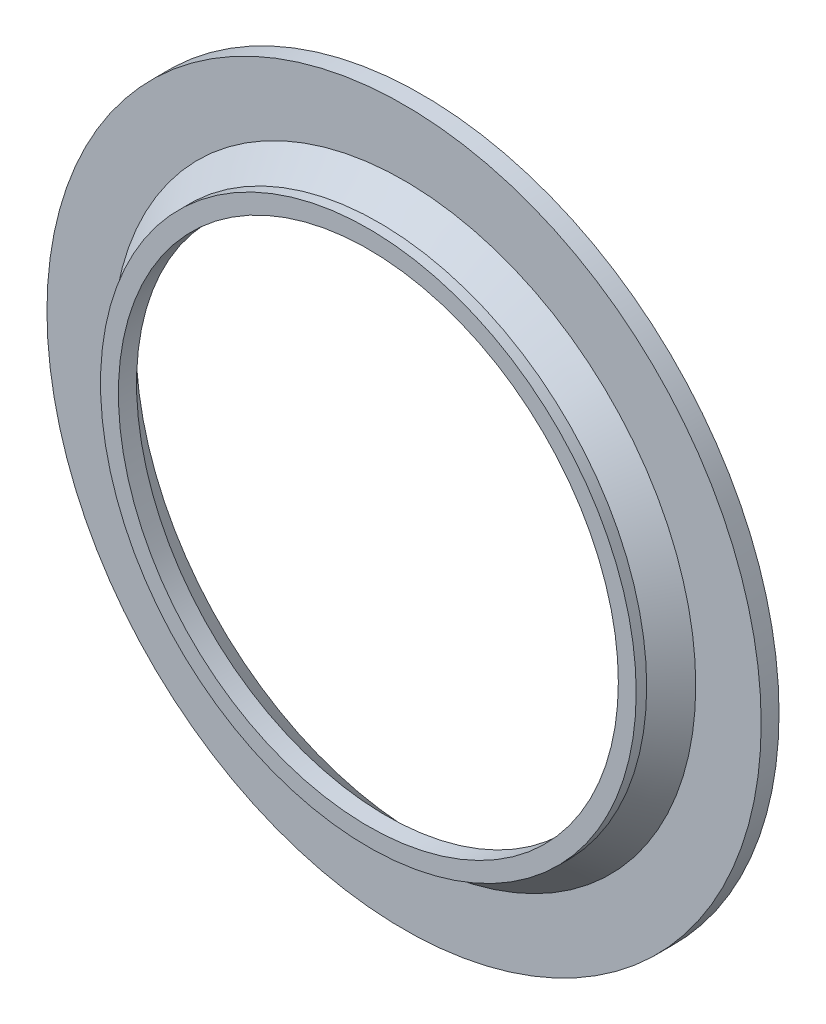
ISO-10303-21;
HEADER;
FILE_DESCRIPTION(('STEP AP214'),'2;1');
FILE_NAME('part.step','',(''),(''),'','','');
FILE_SCHEMA(('AUTOMOTIVE_DESIGN { 1 0 10303 214 1 1 1 1 }'));
ENDSEC;
DATA;
#1=APPLICATION_CONTEXT('core data for automotive mechanical design processes');
#2=APPLICATION_PROTOCOL_DEFINITION('international standard','automotive_design',2000,#1);
#3=PRODUCT_CONTEXT('',#1,'mechanical');
#4=PRODUCT('Part','Part','',(#3));
#5=PRODUCT_RELATED_PRODUCT_CATEGORY('part','',(#4));
#6=PRODUCT_DEFINITION_FORMATION('','',#4);
#7=PRODUCT_DEFINITION_CONTEXT('part definition',#1,'design');
#8=PRODUCT_DEFINITION('design','',#6,#7);
#9=PRODUCT_DEFINITION_SHAPE('','',#8);
#10=(LENGTH_UNIT() NAMED_UNIT(*) SI_UNIT(.MILLI.,.METRE.));
#11=(NAMED_UNIT(*) PLANE_ANGLE_UNIT() SI_UNIT($,.RADIAN.));
#12=(NAMED_UNIT(*) SI_UNIT($,.STERADIAN.) SOLID_ANGLE_UNIT());
#13=UNCERTAINTY_MEASURE_WITH_UNIT(LENGTH_MEASURE(1.E-05),#10,'distance_accuracy_value','');
#14=(GEOMETRIC_REPRESENTATION_CONTEXT(3) GLOBAL_UNCERTAINTY_ASSIGNED_CONTEXT((#13)) GLOBAL_UNIT_ASSIGNED_CONTEXT((#10,
#11,#12)) REPRESENTATION_CONTEXT('',''));
#15=CARTESIAN_POINT('',(0.,0.,0.));
#16=DIRECTION('',(0.,0.,1.));
#17=DIRECTION('',(1.,0.,0.));
#18=AXIS2_PLACEMENT_3D('',#15,#16,#17);
#19=CARTESIAN_POINT('',(1.5,0.,0.));
#20=DIRECTION('',(0.,0.,1.));
#21=DIRECTION('',(1.,0.,0.));
#22=AXIS2_PLACEMENT_3D('',#19,#20,#21);
#23=PLANE('',#22);
#24=CARTESIAN_POINT('',(0.,0.,0.));
#25=DIRECTION('',(0.,0.,1.));
#26=DIRECTION('',(1.,0.,0.));
#27=AXIS2_PLACEMENT_3D('',#24,#25,#26);
#28=CIRCLE('',#27,1.5);
#29=CARTESIAN_POINT('',(1.5,0.,0.));
#30=VERTEX_POINT('',#29);
#31=EDGE_CURVE('E72',#30,#30,#28,.T.);
#32=ORIENTED_EDGE('',*,*,#31,.T.);
#33=EDGE_LOOP('',(#32));
#34=FACE_BOUND('',#33,.T.);
#35=CARTESIAN_POINT('',(0.,0.,0.));
#36=DIRECTION('',(0.,0.,1.));
#37=DIRECTION('',(1.,0.,0.));
#38=AXIS2_PLACEMENT_3D('',#35,#36,#37);
#39=CIRCLE('',#38,1.4);
#40=CARTESIAN_POINT('',(1.4,0.,0.));
#41=VERTEX_POINT('',#40);
#42=EDGE_CURVE('E10',#41,#41,#39,.T.);
#43=ORIENTED_EDGE('',*,*,#42,.F.);
#44=EDGE_LOOP('',(#43));
#45=FACE_BOUND('',#44,.T.);
#46=ADVANCED_FACE('F37',(#34,#45),#23,.T.);
#47=CARTESIAN_POINT('',(0.,0.,0.));
#48=DIRECTION('',(0.,0.,1.));
#49=DIRECTION('',(1.,0.,0.));
#50=AXIS2_PLACEMENT_3D('',#47,#48,#49);
#51=CYLINDRICAL_SURFACE('',#50,1.4);
#52=ORIENTED_EDGE('',*,*,#42,.T.);
#53=EDGE_LOOP('',(#52));
#54=FACE_BOUND('',#53,.T.);
#55=CARTESIAN_POINT('',(0.,0.,-0.101718500595141));
#56=DIRECTION('',(0.,0.,1.));
#57=DIRECTION('',(1.,0.,0.));
#58=AXIS2_PLACEMENT_3D('',#55,#56,#57);
#59=CIRCLE('',#58,1.4);
#60=CARTESIAN_POINT('',(1.4,0.,-0.101718500595141));
#61=VERTEX_POINT('',#60);
#62=EDGE_CURVE('E44',#61,#61,#59,.T.);
#63=ORIENTED_EDGE('',*,*,#62,.F.);
#64=EDGE_LOOP('',(#63));
#65=FACE_BOUND('',#64,.T.);
#66=ADVANCED_FACE('F91',(#54,#65),#51,.F.);
#67=CARTESIAN_POINT('',(0.,0.,-0.3));
#68=DIRECTION('',(0.,0.,-1.));
#69=DIRECTION('',(-1.,0.,0.));
#70=AXIS2_PLACEMENT_3D('',#67,#68,#69);
#71=CONICAL_SURFACE('',#70,1.60199102798198,0.794665405411529);
#72=ORIENTED_EDGE('',*,*,#62,.T.);
#73=EDGE_LOOP('',(#72));
#74=FACE_BOUND('',#73,.T.);
#75=CARTESIAN_POINT('',(0.,0.,-0.3));
#76=DIRECTION('',(0.,0.,1.));
#77=DIRECTION('',(1.,0.,0.));
#78=AXIS2_PLACEMENT_3D('',#75,#76,#77);
#79=CIRCLE('',#78,1.60199102798198);
#80=CARTESIAN_POINT('',(1.60199102798198,0.,-0.3));
#81=VERTEX_POINT('',#80);
#82=EDGE_CURVE('E49',#81,#81,#79,.T.);
#83=ORIENTED_EDGE('',*,*,#82,.F.);
#84=EDGE_LOOP('',(#83));
#85=FACE_BOUND('',#84,.T.);
#86=ADVANCED_FACE('F95',(#74,#85),#71,.F.);
#87=CARTESIAN_POINT('',(1.60199102798198,0.,-0.3));
#88=DIRECTION('',(0.,0.,-1.));
#89=DIRECTION('',(-1.,0.,0.));
#90=AXIS2_PLACEMENT_3D('',#87,#88,#89);
#91=PLANE('',#90);
#92=ORIENTED_EDGE('',*,*,#82,.T.);
#93=EDGE_LOOP('',(#92));
#94=FACE_BOUND('',#93,.T.);
#95=CARTESIAN_POINT('',(0.,0.,-0.3));
#96=DIRECTION('',(0.,0.,1.));
#97=DIRECTION('',(1.,0.,0.));
#98=AXIS2_PLACEMENT_3D('',#95,#96,#97);
#99=CIRCLE('',#98,2.);
#100=CARTESIAN_POINT('',(2.,0.,-0.3));
#101=VERTEX_POINT('',#100);
#102=EDGE_CURVE('E54',#101,#101,#99,.T.);
#103=ORIENTED_EDGE('',*,*,#102,.F.);
#104=EDGE_LOOP('',(#103));
#105=FACE_BOUND('',#104,.T.);
#106=ADVANCED_FACE('F99',(#94,#105),#91,.T.);
#107=CARTESIAN_POINT('',(0.,0.,0.));
#108=DIRECTION('',(0.,0.,1.));
#109=DIRECTION('',(1.,0.,0.));
#110=AXIS2_PLACEMENT_3D('',#107,#108,#109);
#111=CYLINDRICAL_SURFACE('',#110,2.);
#112=ORIENTED_EDGE('',*,*,#102,.T.);
#113=EDGE_LOOP('',(#112));
#114=FACE_BOUND('',#113,.T.);
#115=CARTESIAN_POINT('',(0.,0.,-0.2));
#116=DIRECTION('',(0.,0.,1.));
#117=DIRECTION('',(1.,0.,0.));
#118=AXIS2_PLACEMENT_3D('',#115,#116,#117);
#119=CIRCLE('',#118,2.);
#120=CARTESIAN_POINT('',(2.,0.,-0.2));
#121=VERTEX_POINT('',#120);
#122=EDGE_CURVE('E60',#121,#121,#119,.T.);
#123=ORIENTED_EDGE('',*,*,#122,.F.);
#124=EDGE_LOOP('',(#123));
#125=FACE_BOUND('',#124,.T.);
#126=ADVANCED_FACE('F105',(#114,#125),#111,.T.);
#127=CARTESIAN_POINT('',(1.63350543350026,0.,-0.2));
#128=DIRECTION('',(0.,0.,1.));
#129=DIRECTION('',(1.,0.,0.));
#130=AXIS2_PLACEMENT_3D('',#127,#128,#129);
#131=PLANE('',#130);
#132=ORIENTED_EDGE('',*,*,#122,.T.);
#133=EDGE_LOOP('',(#132));
#134=FACE_BOUND('',#133,.T.);
#135=CARTESIAN_POINT('',(0.,0.,-0.2));
#136=DIRECTION('',(0.,0.,1.));
#137=DIRECTION('',(1.,0.,0.));
#138=AXIS2_PLACEMENT_3D('',#135,#136,#137);
#139=CIRCLE('',#138,1.63350543350026);
#140=CARTESIAN_POINT('',(1.63350543350026,0.,-0.2));
#141=VERTEX_POINT('',#140);
#142=EDGE_CURVE('E64',#141,#141,#139,.T.);
#143=ORIENTED_EDGE('',*,*,#142,.F.);
#144=EDGE_LOOP('',(#143));
#145=FACE_BOUND('',#144,.T.);
#146=ADVANCED_FACE('F87',(#134,#145),#131,.T.);
#147=CARTESIAN_POINT('',(0.,0.,-0.0587561745537941));
#148=DIRECTION('',(0.,0.,-1.));
#149=DIRECTION('',(-1.,0.,0.));
#150=AXIS2_PLACEMENT_3D('',#147,#148,#149);
#151=CONICAL_SURFACE('',#150,1.5,0.757240319758643);
#152=ORIENTED_EDGE('',*,*,#142,.T.);
#153=EDGE_LOOP('',(#152));
#154=FACE_BOUND('',#153,.T.);
#155=CARTESIAN_POINT('',(0.,0.,-0.0587561745537941));
#156=DIRECTION('',(0.,0.,1.));
#157=DIRECTION('',(1.,0.,0.));
#158=AXIS2_PLACEMENT_3D('',#155,#156,#157);
#159=CIRCLE('',#158,1.5);
#160=CARTESIAN_POINT('',(1.5,0.,-0.0587561745537941));
#161=VERTEX_POINT('',#160);
#162=EDGE_CURVE('E68',#161,#161,#159,.T.);
#163=ORIENTED_EDGE('',*,*,#162,.F.);
#164=EDGE_LOOP('',(#163));
#165=FACE_BOUND('',#164,.T.);
#166=ADVANCED_FACE('F81',(#154,#165),#151,.T.);
#167=CARTESIAN_POINT('',(0.,0.,0.));
#168=DIRECTION('',(0.,0.,1.));
#169=DIRECTION('',(1.,0.,0.));
#170=AXIS2_PLACEMENT_3D('',#167,#168,#169);
#171=CYLINDRICAL_SURFACE('',#170,1.5);
#172=ORIENTED_EDGE('',*,*,#162,.T.);
#173=EDGE_LOOP('',(#172));
#174=FACE_BOUND('',#173,.T.);
#175=ORIENTED_EDGE('',*,*,#31,.F.);
#176=EDGE_LOOP('',(#175));
#177=FACE_BOUND('',#176,.T.);
#178=ADVANCED_FACE('F79',(#174,#177),#171,.T.);
#179=CLOSED_SHELL('',(#46,#66,#86,#106,#126,#146,#166,#178));
#180=MANIFOLD_SOLID_BREP('B2',#179);
#181=ADVANCED_BREP_SHAPE_REPRESENTATION('',(#18,#180),#14);
#182=SHAPE_DEFINITION_REPRESENTATION(#9,#181);
ENDSEC;
END-ISO-10303-21;
